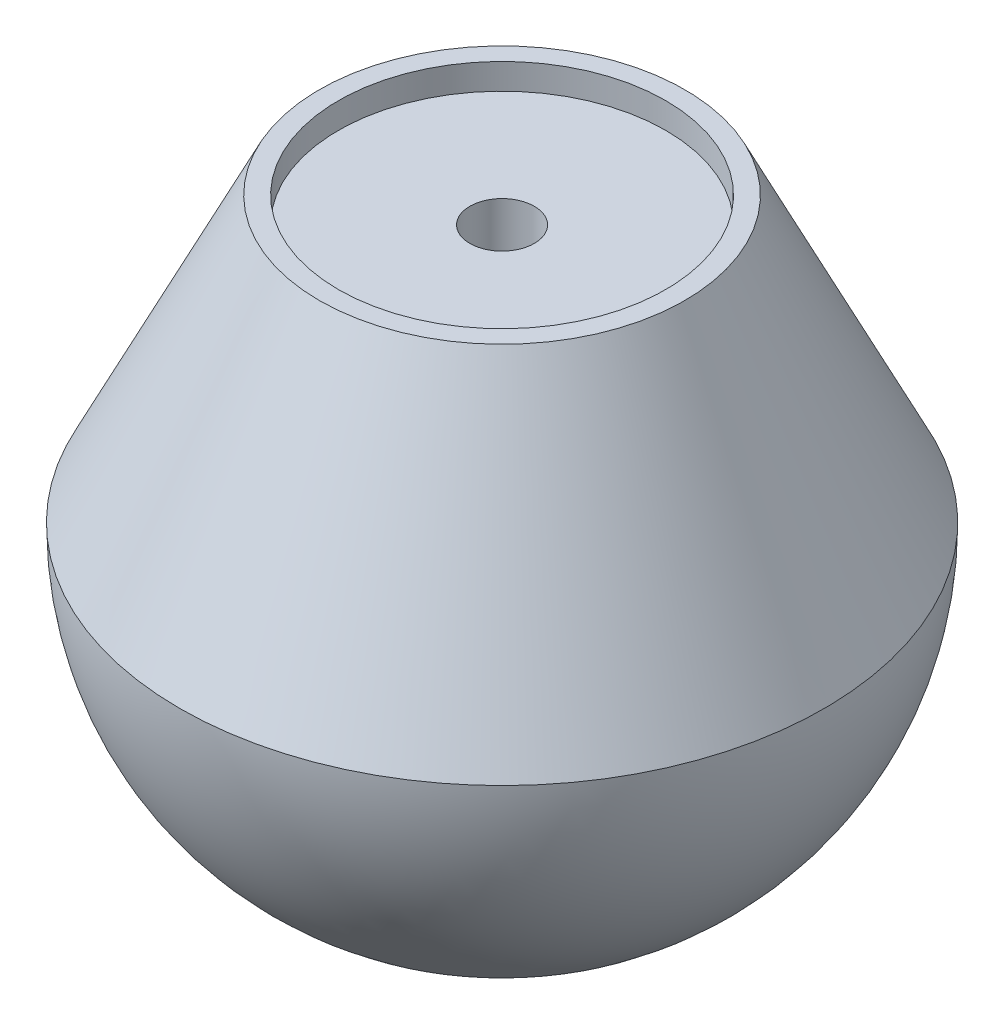
ISO-10303-21;
HEADER;
FILE_DESCRIPTION(('STEP AP214'),'2;1');
FILE_NAME('part.step','',(''),(''),'','','');
FILE_SCHEMA(('AUTOMOTIVE_DESIGN { 1 0 10303 214 1 1 1 1 }'));
ENDSEC;
DATA;
#1=APPLICATION_CONTEXT('core data for automotive mechanical design processes');
#2=APPLICATION_PROTOCOL_DEFINITION('international standard','automotive_design',2000,#1);
#3=PRODUCT_CONTEXT('',#1,'mechanical');
#4=PRODUCT('Part','Part','',(#3));
#5=PRODUCT_RELATED_PRODUCT_CATEGORY('part','',(#4));
#6=PRODUCT_DEFINITION_FORMATION('','',#4);
#7=PRODUCT_DEFINITION_CONTEXT('part definition',#1,'design');
#8=PRODUCT_DEFINITION('design','',#6,#7);
#9=PRODUCT_DEFINITION_SHAPE('','',#8);
#10=(LENGTH_UNIT() NAMED_UNIT(*) SI_UNIT(.MILLI.,.METRE.));
#11=(NAMED_UNIT(*) PLANE_ANGLE_UNIT() SI_UNIT($,.RADIAN.));
#12=(NAMED_UNIT(*) SI_UNIT($,.STERADIAN.) SOLID_ANGLE_UNIT());
#13=UNCERTAINTY_MEASURE_WITH_UNIT(LENGTH_MEASURE(1.E-05),#10,'distance_accuracy_value','');
#14=(GEOMETRIC_REPRESENTATION_CONTEXT(3) GLOBAL_UNCERTAINTY_ASSIGNED_CONTEXT((#13)) GLOBAL_UNIT_ASSIGNED_CONTEXT((#10,
#11,#12)) REPRESENTATION_CONTEXT('',''));
#15=CARTESIAN_POINT('',(0.,0.,0.));
#16=DIRECTION('',(0.,0.,1.));
#17=DIRECTION('',(1.,0.,0.));
#18=AXIS2_PLACEMENT_3D('',#15,#16,#17);
#19=CARTESIAN_POINT('',(0.,22.,0.));
#20=DIRECTION('',(0.,-1.,0.));
#21=DIRECTION('',(0.,0.,-1.));
#22=AXIS2_PLACEMENT_3D('',#19,#20,#21);
#23=CONICAL_SURFACE('',#22,14.176,0.457227151477827);
#24=CARTESIAN_POINT('',(0.,0.,0.));
#25=DIRECTION('',(0.,1.,0.));
#26=DIRECTION('',(0.,0.,1.));
#27=AXIS2_PLACEMENT_3D('',#24,#25,#26);
#28=CIRCLE('',#27,25.);
#29=CARTESIAN_POINT('',(0.,0.,25.));
#30=VERTEX_POINT('',#29);
#31=EDGE_CURVE('E59',#30,#30,#28,.T.);
#32=ORIENTED_EDGE('',*,*,#31,.T.);
#33=EDGE_LOOP('',(#32));
#34=FACE_BOUND('',#33,.T.);
#35=CARTESIAN_POINT('',(0.,22.,0.));
#36=DIRECTION('',(0.,1.,0.));
#37=DIRECTION('',(0.,0.,1.));
#38=AXIS2_PLACEMENT_3D('',#35,#36,#37);
#39=CIRCLE('',#38,14.176);
#40=CARTESIAN_POINT('',(0.,22.,14.176));
#41=VERTEX_POINT('',#40);
#42=EDGE_CURVE('E77',#41,#41,#39,.T.);
#43=ORIENTED_EDGE('',*,*,#42,.F.);
#44=EDGE_LOOP('',(#43));
#45=FACE_BOUND('',#44,.T.);
#46=ADVANCED_FACE('F39',(#34,#45),#23,.T.);
#47=CARTESIAN_POINT('',(0.,0.,0.));
#48=DIRECTION('',(0.,1.,0.));
#49=DIRECTION('',(-1.,0.,0.));
#50=AXIS2_PLACEMENT_3D('',#47,#48,#49);
#51=SPHERICAL_SURFACE('',#50,25.);
#52=CARTESIAN_POINT('',(0.,-21.9387755102041,0.));
#53=DIRECTION('',(0.,1.,0.));
#54=DIRECTION('',(0.,0.,1.));
#55=AXIS2_PLACEMENT_3D('',#52,#53,#54);
#56=CIRCLE('',#55,11.987081759664);
#57=CARTESIAN_POINT('',(0.,-21.9387755102041,11.987081759664));
#58=VERTEX_POINT('',#57);
#59=EDGE_CURVE('E54',#58,#58,#56,.T.);
#60=ORIENTED_EDGE('',*,*,#59,.T.);
#61=EDGE_LOOP('',(#60));
#62=FACE_BOUND('',#61,.T.);
#63=ORIENTED_EDGE('',*,*,#31,.F.);
#64=EDGE_LOOP('',(#63));
#65=FACE_BOUND('',#64,.T.);
#66=ADVANCED_FACE('F85',(#62,#65),#51,.T.);
#67=CARTESIAN_POINT('',(0.,-22.,0.));
#68=DIRECTION('',(0.,1.,0.));
#69=DIRECTION('',(0.,0.,1.));
#70=AXIS2_PLACEMENT_3D('',#67,#68,#69);
#71=PLANE('',#70);
#72=CARTESIAN_POINT('',(0.,-22.,0.));
#73=DIRECTION('',(0.,1.,0.));
#74=DIRECTION('',(0.,0.,1.));
#75=AXIS2_PLACEMENT_3D('',#72,#73,#74);
#76=CIRCLE('',#75,11.7473401244707);
#77=CARTESIAN_POINT('',(0.,-22.,11.7473401244707));
#78=VERTEX_POINT('',#77);
#79=EDGE_CURVE('E46',#78,#78,#76,.F.);
#80=ORIENTED_EDGE('',*,*,#79,.T.);
#81=EDGE_LOOP('',(#80));
#82=FACE_BOUND('',#81,.T.);
#83=CARTESIAN_POINT('',(0.,-22.,0.));
#84=DIRECTION('',(0.,1.,0.));
#85=DIRECTION('',(0.,0.,1.));
#86=AXIS2_PLACEMENT_3D('',#83,#84,#85);
#87=CIRCLE('',#86,5.5);
#88=CARTESIAN_POINT('',(0.,-22.,5.5));
#89=VERTEX_POINT('',#88);
#90=EDGE_CURVE('E50',#89,#89,#87,.T.);
#91=ORIENTED_EDGE('',*,*,#90,.T.);
#92=EDGE_LOOP('',(#91));
#93=FACE_BOUND('',#92,.T.);
#94=ADVANCED_FACE('F92',(#82,#93),#71,.F.);
#95=CARTESIAN_POINT('',(0.,0.,0.));
#96=DIRECTION('',(0.,1.,0.));
#97=DIRECTION('',(0.,0.,1.));
#98=AXIS2_PLACEMENT_3D('',#95,#96,#97);
#99=CYLINDRICAL_SURFACE('',#98,5.);
#100=CARTESIAN_POINT('',(0.,-21.5,0.));
#101=DIRECTION('',(0.,1.,0.));
#102=DIRECTION('',(0.,0.,1.));
#103=AXIS2_PLACEMENT_3D('',#100,#101,#102);
#104=CIRCLE('',#103,5.);
#105=CARTESIAN_POINT('',(0.,-21.5,5.));
#106=VERTEX_POINT('',#105);
#107=EDGE_CURVE('E10',#106,#106,#104,.F.);
#108=ORIENTED_EDGE('',*,*,#107,.T.);
#109=EDGE_LOOP('',(#108));
#110=FACE_BOUND('',#109,.T.);
#111=CARTESIAN_POINT('',(0.,0.,0.));
#112=DIRECTION('',(0.,1.,0.));
#113=DIRECTION('',(0.,0.,1.));
#114=AXIS2_PLACEMENT_3D('',#111,#112,#113);
#115=CIRCLE('',#114,5.);
#116=CARTESIAN_POINT('',(0.,0.,5.));
#117=VERTEX_POINT('',#116);
#118=EDGE_CURVE('E62',#117,#117,#115,.T.);
#119=ORIENTED_EDGE('',*,*,#118,.T.);
#120=EDGE_LOOP('',(#119));
#121=FACE_BOUND('',#120,.T.);
#122=ADVANCED_FACE('F127',(#110,#121),#99,.F.);
#123=CARTESIAN_POINT('',(0.,0.,0.));
#124=DIRECTION('',(0.,1.,0.));
#125=DIRECTION('',(0.,0.,1.));
#126=AXIS2_PLACEMENT_3D('',#123,#124,#125);
#127=PLANE('',#126);
#128=ORIENTED_EDGE('',*,*,#118,.F.);
#129=EDGE_LOOP('',(#128));
#130=FACE_BOUND('',#129,.T.);
#131=CARTESIAN_POINT('',(0.,0.,0.));
#132=DIRECTION('',(0.,1.,0.));
#133=DIRECTION('',(0.,0.,1.));
#134=AXIS2_PLACEMENT_3D('',#131,#132,#133);
#135=CIRCLE('',#134,2.5);
#136=CARTESIAN_POINT('',(0.,0.,2.5));
#137=VERTEX_POINT('',#136);
#138=EDGE_CURVE('E65',#137,#137,#135,.T.);
#139=ORIENTED_EDGE('',*,*,#138,.T.);
#140=EDGE_LOOP('',(#139));
#141=FACE_BOUND('',#140,.T.);
#142=ADVANCED_FACE('F124',(#130,#141),#127,.F.);
#143=CARTESIAN_POINT('',(0.,0.,0.));
#144=DIRECTION('',(0.,1.,0.));
#145=DIRECTION('',(0.,0.,1.));
#146=AXIS2_PLACEMENT_3D('',#143,#144,#145);
#147=CYLINDRICAL_SURFACE('',#146,2.5);
#148=ORIENTED_EDGE('',*,*,#138,.F.);
#149=EDGE_LOOP('',(#148));
#150=FACE_BOUND('',#149,.T.);
#151=CARTESIAN_POINT('',(0.,20.,0.));
#152=DIRECTION('',(0.,1.,0.));
#153=DIRECTION('',(0.,0.,1.));
#154=AXIS2_PLACEMENT_3D('',#151,#152,#153);
#155=CIRCLE('',#154,2.5);
#156=CARTESIAN_POINT('',(0.,20.,2.5));
#157=VERTEX_POINT('',#156);
#158=EDGE_CURVE('E68',#157,#157,#155,.T.);
#159=ORIENTED_EDGE('',*,*,#158,.T.);
#160=EDGE_LOOP('',(#159));
#161=FACE_BOUND('',#160,.T.);
#162=ADVANCED_FACE('F120',(#150,#161),#147,.F.);
#163=CARTESIAN_POINT('',(0.,20.,0.));
#164=DIRECTION('',(0.,-1.,0.));
#165=DIRECTION('',(0.,0.,-1.));
#166=AXIS2_PLACEMENT_3D('',#163,#164,#165);
#167=PLANE('',#166);
#168=ORIENTED_EDGE('',*,*,#158,.F.);
#169=EDGE_LOOP('',(#168));
#170=FACE_BOUND('',#169,.T.);
#171=CARTESIAN_POINT('',(0.,20.,0.));
#172=DIRECTION('',(0.,1.,0.));
#173=DIRECTION('',(0.,0.,1.));
#174=AXIS2_PLACEMENT_3D('',#171,#172,#173);
#175=CIRCLE('',#174,12.7);
#176=CARTESIAN_POINT('',(0.,20.,12.7));
#177=VERTEX_POINT('',#176);
#178=EDGE_CURVE('E71',#177,#177,#175,.T.);
#179=ORIENTED_EDGE('',*,*,#178,.T.);
#180=EDGE_LOOP('',(#179));
#181=FACE_BOUND('',#180,.T.);
#182=ADVANCED_FACE('F114',(#170,#181),#167,.F.);
#183=CARTESIAN_POINT('',(0.,0.,0.));
#184=DIRECTION('',(0.,1.,0.));
#185=DIRECTION('',(0.,0.,1.));
#186=AXIS2_PLACEMENT_3D('',#183,#184,#185);
#187=CYLINDRICAL_SURFACE('',#186,12.7);
#188=ORIENTED_EDGE('',*,*,#178,.F.);
#189=EDGE_LOOP('',(#188));
#190=FACE_BOUND('',#189,.T.);
#191=CARTESIAN_POINT('',(0.,22.,0.));
#192=DIRECTION('',(0.,1.,0.));
#193=DIRECTION('',(0.,0.,1.));
#194=AXIS2_PLACEMENT_3D('',#191,#192,#193);
#195=CIRCLE('',#194,12.7);
#196=CARTESIAN_POINT('',(0.,22.,12.7));
#197=VERTEX_POINT('',#196);
#198=EDGE_CURVE('E74',#197,#197,#195,.T.);
#199=ORIENTED_EDGE('',*,*,#198,.T.);
#200=EDGE_LOOP('',(#199));
#201=FACE_BOUND('',#200,.T.);
#202=ADVANCED_FACE('F105',(#190,#201),#187,.F.);
#203=CARTESIAN_POINT('',(0.,22.,0.));
#204=DIRECTION('',(0.,1.,0.));
#205=DIRECTION('',(0.,0.,1.));
#206=AXIS2_PLACEMENT_3D('',#203,#204,#205);
#207=PLANE('',#206);
#208=ORIENTED_EDGE('',*,*,#42,.T.);
#209=EDGE_LOOP('',(#208));
#210=FACE_BOUND('',#209,.T.);
#211=ORIENTED_EDGE('',*,*,#198,.F.);
#212=EDGE_LOOP('',(#211));
#213=FACE_BOUND('',#212,.T.);
#214=ADVANCED_FACE('F81',(#210,#213),#207,.T.);
#215=CARTESIAN_POINT('',(0.,-21.5,0.));
#216=DIRECTION('',(0.,1.,0.));
#217=DIRECTION('',(0.,0.,1.));
#218=AXIS2_PLACEMENT_3D('',#215,#216,#217);
#219=TOROIDAL_SURFACE('',#218,11.7473401244707,0.5);
#220=ORIENTED_EDGE('',*,*,#79,.F.);
#221=EDGE_LOOP('',(#220));
#222=FACE_BOUND('',#221,.T.);
#223=ORIENTED_EDGE('',*,*,#59,.F.);
#224=EDGE_LOOP('',(#223));
#225=FACE_BOUND('',#224,.T.);
#226=ADVANCED_FACE('F96',(#222,#225),#219,.T.);
#227=CARTESIAN_POINT('',(0.,-21.5,0.));
#228=DIRECTION('',(0.,1.,0.));
#229=DIRECTION('',(0.,0.,1.));
#230=AXIS2_PLACEMENT_3D('',#227,#228,#229);
#231=TOROIDAL_SURFACE('',#230,5.5,0.5);
#232=ORIENTED_EDGE('',*,*,#107,.F.);
#233=EDGE_LOOP('',(#232));
#234=FACE_BOUND('',#233,.T.);
#235=ORIENTED_EDGE('',*,*,#90,.F.);
#236=EDGE_LOOP('',(#235));
#237=FACE_BOUND('',#236,.T.);
#238=ADVANCED_FACE('F41',(#234,#237),#231,.T.);
#239=CLOSED_SHELL('',(#46,#66,#94,#122,#142,#162,#182,#202,#214,#226,#238));
#240=MANIFOLD_SOLID_BREP('B2',#239);
#241=ADVANCED_BREP_SHAPE_REPRESENTATION('',(#18,#240),#14);
#242=SHAPE_DEFINITION_REPRESENTATION(#9,#241);
ENDSEC;
END-ISO-10303-21;
